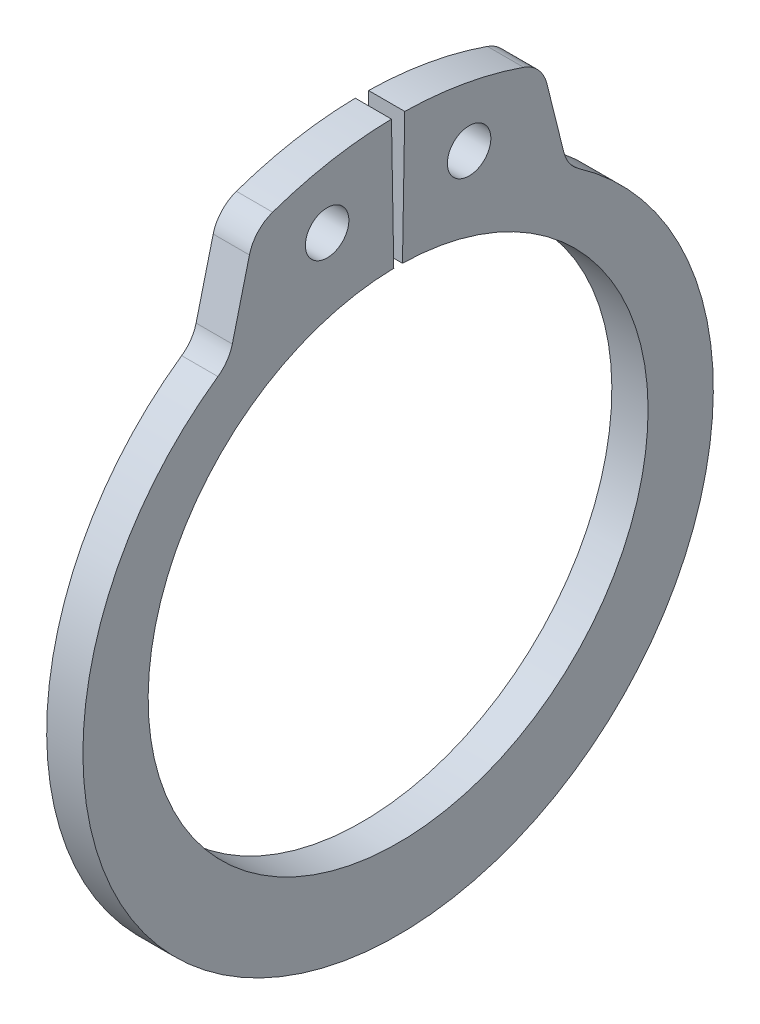
ISO-10303-21;
HEADER;
FILE_DESCRIPTION(('STEP AP214'),'2;1');
FILE_NAME('part.step','',(''),(''),'','','');
FILE_SCHEMA(('AUTOMOTIVE_DESIGN { 1 0 10303 214 1 1 1 1 }'));
ENDSEC;
DATA;
#1=APPLICATION_CONTEXT('core data for automotive mechanical design processes');
#2=APPLICATION_PROTOCOL_DEFINITION('international standard','automotive_design',2000,#1);
#3=PRODUCT_CONTEXT('',#1,'mechanical');
#4=PRODUCT('Part','Part','',(#3));
#5=PRODUCT_RELATED_PRODUCT_CATEGORY('part','',(#4));
#6=PRODUCT_DEFINITION_FORMATION('','',#4);
#7=PRODUCT_DEFINITION_CONTEXT('part definition',#1,'design');
#8=PRODUCT_DEFINITION('design','',#6,#7);
#9=PRODUCT_DEFINITION_SHAPE('','',#8);
#10=(LENGTH_UNIT() NAMED_UNIT(*) SI_UNIT(.MILLI.,.METRE.));
#11=(NAMED_UNIT(*) PLANE_ANGLE_UNIT() SI_UNIT($,.RADIAN.));
#12=(NAMED_UNIT(*) SI_UNIT($,.STERADIAN.) SOLID_ANGLE_UNIT());
#13=UNCERTAINTY_MEASURE_WITH_UNIT(LENGTH_MEASURE(1.E-05),#10,'distance_accuracy_value','');
#14=(GEOMETRIC_REPRESENTATION_CONTEXT(3) GLOBAL_UNCERTAINTY_ASSIGNED_CONTEXT((#13)) GLOBAL_UNIT_ASSIGNED_CONTEXT((#10,
#11,#12)) REPRESENTATION_CONTEXT('',''));
#15=CARTESIAN_POINT('',(0.,0.,0.));
#16=DIRECTION('',(0.,0.,1.));
#17=DIRECTION('',(1.,0.,0.));
#18=AXIS2_PLACEMENT_3D('',#15,#16,#17);
#19=CARTESIAN_POINT('',(-0.5,0.,0.));
#20=DIRECTION('',(1.,0.,0.));
#21=DIRECTION('',(0.,0.,-1.));
#22=AXIS2_PLACEMENT_3D('',#19,#20,#21);
#23=PLANE('',#22);
#24=CARTESIAN_POINT('',(-0.5,8.66711980549086,-1.9596288316201));
#25=DIRECTION('',(-1.,0.,0.));
#26=DIRECTION('',(0.,0.,1.));
#27=AXIS2_PLACEMENT_3D('',#24,#25,#26);
#28=CIRCLE('',#27,0.6);
#29=CARTESIAN_POINT('',(-0.5,8.66711980549086,-1.3596288316201));
#30=VERTEX_POINT('',#29);
#31=EDGE_CURVE('E147',#30,#30,#28,.F.);
#32=ORIENTED_EDGE('',*,*,#31,.T.);
#33=EDGE_LOOP('',(#32));
#34=FACE_BOUND('',#33,.T.);
#35=CARTESIAN_POINT('',(-0.5,8.96816184312502,3.13401869099666));
#36=DIRECTION('',(-1.,0.,0.));
#37=DIRECTION('',(0.,0.,1.));
#38=AXIS2_PLACEMENT_3D('',#35,#36,#37);
#39=CIRCLE('',#38,1.);
#40=CARTESIAN_POINT('',(-0.5,9.91217887924345,3.46391539531209));
#41=VERTEX_POINT('',#40);
#42=CARTESIAN_POINT('',(-0.5,9.21008373872469,4.10431441727265));
#43=VERTEX_POINT('',#42);
#44=EDGE_CURVE('E130',#41,#43,#39,.F.);
#45=ORIENTED_EDGE('',*,*,#44,.F.);
#46=CARTESIAN_POINT('',(-0.5,0.,0.));
#47=DIRECTION('',(-1.,0.,0.));
#48=DIRECTION('',(0.,0.,1.));
#49=AXIS2_PLACEMENT_3D('',#46,#47,#48);
#50=CIRCLE('',#49,10.5);
#51=CARTESIAN_POINT('',(-0.5,10.4984007991421,0.183250267591477));
#52=VERTEX_POINT('',#51);
#53=EDGE_CURVE('E123',#52,#41,#50,.F.);
#54=ORIENTED_EDGE('',*,*,#53,.F.);
#55=DIRECTION('',(0.,-0.999847695156391,-0.0174524064372835));
#56=VECTOR('',#55,1.);
#57=CARTESIAN_POINT('',(-0.5,6.8989490965791,0.120421604417256));
#58=LINE('',#57,#56);
#59=CARTESIAN_POINT('',(-0.5,6.8989490965791,0.120421604417256));
#60=VERTEX_POINT('',#59);
#61=EDGE_CURVE('E127',#52,#60,#58,.T.);
#62=ORIENTED_EDGE('',*,*,#61,.T.);
#63=CARTESIAN_POINT('',(-0.5,0.,0.));
#64=DIRECTION('',(-1.,0.,0.));
#65=DIRECTION('',(0.,0.,1.));
#66=AXIS2_PLACEMENT_3D('',#63,#64,#65);
#67=CIRCLE('',#66,6.9);
#68=CARTESIAN_POINT('',(-0.5,6.8989490965791,-0.120421604417256));
#69=VERTEX_POINT('',#68);
#70=EDGE_CURVE('E204',#60,#69,#67,.F.);
#71=ORIENTED_EDGE('',*,*,#70,.T.);
#72=DIRECTION('',(0.,0.999847695156391,-0.0174524064372841));
#73=VECTOR('',#72,1.);
#74=CARTESIAN_POINT('',(-0.5,10.4984007991421,-0.183250267591479));
#75=LINE('',#74,#73);
#76=CARTESIAN_POINT('',(-0.5,10.4984007991421,-0.183250267591479));
#77=VERTEX_POINT('',#76);
#78=EDGE_CURVE('E157',#69,#77,#75,.T.);
#79=ORIENTED_EDGE('',*,*,#78,.T.);
#80=CARTESIAN_POINT('',(-0.5,0.,0.));
#81=DIRECTION('',(-1.,0.,0.));
#82=DIRECTION('',(0.,0.,1.));
#83=AXIS2_PLACEMENT_3D('',#80,#81,#82);
#84=CIRCLE('',#83,10.5);
#85=CARTESIAN_POINT('',(-0.5,9.91217887924345,-3.46391539531209));
#86=VERTEX_POINT('',#85);
#87=EDGE_CURVE('E207',#86,#77,#84,.F.);
#88=ORIENTED_EDGE('',*,*,#87,.F.);
#89=CARTESIAN_POINT('',(-0.5,8.96816184312502,-3.13401869099665));
#90=DIRECTION('',(-1.,0.,0.));
#91=DIRECTION('',(0.,0.,1.));
#92=AXIS2_PLACEMENT_3D('',#89,#90,#91);
#93=CIRCLE('',#92,1.);
#94=CARTESIAN_POINT('',(-0.5,9.21008373872469,-4.10431441727265));
#95=VERTEX_POINT('',#94);
#96=EDGE_CURVE('E211',#95,#86,#93,.F.);
#97=ORIENTED_EDGE('',*,*,#96,.F.);
#98=DIRECTION('',(0.,-0.970295726275997,-0.241921895599666));
#99=VECTOR('',#98,1.);
#100=CARTESIAN_POINT('',(-0.5,9.71734472745919,-3.97784004803122));
#101=LINE('',#100,#99);
#102=CARTESIAN_POINT('',(-0.5,7.31761530924591,-4.57615979123836));
#103=VERTEX_POINT('',#102);
#104=EDGE_CURVE('E163',#95,#103,#101,.T.);
#105=ORIENTED_EDGE('',*,*,#104,.T.);
#106=CARTESIAN_POINT('',(-0.5,7.55953720484558,-5.54645551751436));
#107=DIRECTION('',(-1.,0.,0.));
#108=DIRECTION('',(0.,0.,1.));
#109=AXIS2_PLACEMENT_3D('',#106,#107,#108);
#110=CIRCLE('',#109,1.);
#111=CARTESIAN_POINT('',(-0.5,6.73911195964233,-4.97470170945253));
#112=VERTEX_POINT('',#111);
#113=EDGE_CURVE('E214',#103,#112,#110,.F.);
#114=ORIENTED_EDGE('',*,*,#113,.T.);
#115=CARTESIAN_POINT('',(-0.5,-0.399224177769538,0.));
#116=DIRECTION('',(-1.,0.,0.));
#117=DIRECTION('',(0.,0.,1.));
#118=AXIS2_PLACEMENT_3D('',#115,#116,#117);
#119=CIRCLE('',#118,8.70077582223046);
#120=CARTESIAN_POINT('',(-0.5,6.73911195964233,4.97470170945253));
#121=VERTEX_POINT('',#120);
#122=EDGE_CURVE('E218',#121,#112,#119,.F.);
#123=ORIENTED_EDGE('',*,*,#122,.F.);
#124=CARTESIAN_POINT('',(-0.5,7.55953720484558,5.54645551751436));
#125=DIRECTION('',(-1.,0.,0.));
#126=DIRECTION('',(0.,0.,1.));
#127=AXIS2_PLACEMENT_3D('',#124,#125,#126);
#128=CIRCLE('',#127,1.);
#129=CARTESIAN_POINT('',(-0.5,7.31761530924591,4.57615979123836));
#130=VERTEX_POINT('',#129);
#131=EDGE_CURVE('E170',#121,#130,#128,.F.);
#132=ORIENTED_EDGE('',*,*,#131,.T.);
#133=DIRECTION('',(0.,0.970295726275997,-0.241921895599665));
#134=VECTOR('',#133,1.);
#135=CARTESIAN_POINT('',(-0.5,9.71734472745919,3.97784004803122));
#136=LINE('',#135,#134);
#137=EDGE_CURVE('E169',#130,#43,#136,.T.);
#138=ORIENTED_EDGE('',*,*,#137,.T.);
#139=EDGE_LOOP('',(#45,#54,#62,#71,#79,#88,#97,#105,#114,#123,#132,#138));
#140=FACE_BOUND('',#139,.T.);
#141=CARTESIAN_POINT('',(-0.5,8.66711980549086,1.9596288316201));
#142=DIRECTION('',(-1.,0.,0.));
#143=DIRECTION('',(0.,0.,1.));
#144=AXIS2_PLACEMENT_3D('',#141,#142,#143);
#145=CIRCLE('',#144,0.6);
#146=CARTESIAN_POINT('',(-0.5,8.66711980549086,2.5596288316201));
#147=VERTEX_POINT('',#146);
#148=EDGE_CURVE('E20',#147,#147,#145,.F.);
#149=ORIENTED_EDGE('',*,*,#148,.T.);
#150=EDGE_LOOP('',(#149));
#151=FACE_BOUND('',#150,.T.);
#152=ADVANCED_FACE('F17',(#34,#140,#151),#23,.F.);
#153=CARTESIAN_POINT('',(0.5,8.66711980549086,1.9596288316201));
#154=DIRECTION('',(-1.,0.,0.));
#155=DIRECTION('',(0.,0.,1.));
#156=AXIS2_PLACEMENT_3D('',#153,#154,#155);
#157=CYLINDRICAL_SURFACE('',#156,0.6);
#158=CARTESIAN_POINT('',(0.5,8.66711980549086,1.9596288316201));
#159=DIRECTION('',(-1.,0.,0.));
#160=DIRECTION('',(0.,0.,1.));
#161=AXIS2_PLACEMENT_3D('',#158,#159,#160);
#162=CIRCLE('',#161,0.6);
#163=CARTESIAN_POINT('',(0.5,8.66711980549086,2.5596288316201));
#164=VERTEX_POINT('',#163);
#165=EDGE_CURVE('E152',#164,#164,#162,.T.);
#166=ORIENTED_EDGE('',*,*,#165,.F.);
#167=EDGE_LOOP('',(#166));
#168=FACE_BOUND('',#167,.T.);
#169=ORIENTED_EDGE('',*,*,#148,.F.);
#170=EDGE_LOOP('',(#169));
#171=FACE_BOUND('',#170,.T.);
#172=ADVANCED_FACE('F319',(#168,#171),#157,.F.);
#173=CARTESIAN_POINT('',(0.5,0.,0.));
#174=DIRECTION('',(-1.,0.,0.));
#175=DIRECTION('',(0.,0.,1.));
#176=AXIS2_PLACEMENT_3D('',#173,#174,#175);
#177=CYLINDRICAL_SURFACE('',#176,10.5);
#178=CARTESIAN_POINT('',(0.5,0.,0.));
#179=DIRECTION('',(-1.,0.,0.));
#180=DIRECTION('',(0.,0.,1.));
#181=AXIS2_PLACEMENT_3D('',#178,#179,#180);
#182=CIRCLE('',#181,10.5);
#183=CARTESIAN_POINT('',(0.5,10.4984007991421,0.183250267591477));
#184=VERTEX_POINT('',#183);
#185=CARTESIAN_POINT('',(0.5,9.91217887924345,3.46391539531209));
#186=VERTEX_POINT('',#185);
#187=EDGE_CURVE('E139',#184,#186,#182,.F.);
#188=ORIENTED_EDGE('',*,*,#187,.F.);
#189=DIRECTION('',(1.,0.,0.));
#190=VECTOR('',#189,1.);
#191=CARTESIAN_POINT('',(0.5,10.4984007991421,0.183250267591477));
#192=LINE('',#191,#190);
#193=EDGE_CURVE('E136',#184,#52,#192,.F.);
#194=ORIENTED_EDGE('',*,*,#193,.T.);
#195=ORIENTED_EDGE('',*,*,#53,.T.);
#196=DIRECTION('',(-1.,0.,0.));
#197=VECTOR('',#196,1.);
#198=CARTESIAN_POINT('',(0.5,9.91217887924345,3.46391539531209));
#199=LINE('',#198,#197);
#200=EDGE_CURVE('E134',#186,#41,#199,.T.);
#201=ORIENTED_EDGE('',*,*,#200,.F.);
#202=EDGE_LOOP('',(#188,#194,#195,#201));
#203=FACE_BOUND('',#202,.T.);
#204=ADVANCED_FACE('F137',(#203),#177,.T.);
#205=CARTESIAN_POINT('',(0.5,8.96816184312502,3.13401869099666));
#206=DIRECTION('',(-1.,0.,0.));
#207=DIRECTION('',(0.,0.,1.));
#208=AXIS2_PLACEMENT_3D('',#205,#206,#207);
#209=CYLINDRICAL_SURFACE('',#208,1.);
#210=ORIENTED_EDGE('',*,*,#44,.T.);
#211=DIRECTION('',(1.,0.,0.));
#212=VECTOR('',#211,1.);
#213=CARTESIAN_POINT('',(0.5,9.21008373872469,4.10431441727265));
#214=LINE('',#213,#212);
#215=CARTESIAN_POINT('',(0.5,9.21008373872469,4.10431441727265));
#216=VERTEX_POINT('',#215);
#217=EDGE_CURVE('E171',#43,#216,#214,.T.);
#218=ORIENTED_EDGE('',*,*,#217,.T.);
#219=CARTESIAN_POINT('',(0.5,8.96816184312502,3.13401869099666));
#220=DIRECTION('',(-1.,0.,0.));
#221=DIRECTION('',(0.,0.,1.));
#222=AXIS2_PLACEMENT_3D('',#219,#220,#221);
#223=CIRCLE('',#222,1.);
#224=EDGE_CURVE('E196',#186,#216,#223,.F.);
#225=ORIENTED_EDGE('',*,*,#224,.F.);
#226=ORIENTED_EDGE('',*,*,#200,.T.);
#227=EDGE_LOOP('',(#210,#218,#225,#226));
#228=FACE_BOUND('',#227,.T.);
#229=ADVANCED_FACE('F227',(#228),#209,.T.);
#230=CARTESIAN_POINT('',(0.5,9.71734472745919,3.97784004803122));
#231=DIRECTION('',(0.,-0.241921895599665,-0.970295726275997));
#232=DIRECTION('',(0.,0.970295726275997,-0.241921895599665));
#233=AXIS2_PLACEMENT_3D('',#230,#231,#232);
#234=PLANE('',#233);
#235=DIRECTION('',(-1.,0.,0.));
#236=VECTOR('',#235,1.);
#237=CARTESIAN_POINT('',(0.5,7.31761530924591,4.57615979123836));
#238=LINE('',#237,#236);
#239=CARTESIAN_POINT('',(0.5,7.31761530924591,4.57615979123836));
#240=VERTEX_POINT('',#239);
#241=EDGE_CURVE('E224',#130,#240,#238,.F.);
#242=ORIENTED_EDGE('',*,*,#241,.T.);
#243=DIRECTION('',(0.,-0.970295726275997,0.241921895599665));
#244=VECTOR('',#243,1.);
#245=CARTESIAN_POINT('',(0.5,9.21008373872469,4.10431441727265));
#246=LINE('',#245,#244);
#247=EDGE_CURVE('E195',#216,#240,#246,.T.);
#248=ORIENTED_EDGE('',*,*,#247,.F.);
#249=ORIENTED_EDGE('',*,*,#217,.F.);
#250=ORIENTED_EDGE('',*,*,#137,.F.);
#251=EDGE_LOOP('',(#242,#248,#249,#250));
#252=FACE_BOUND('',#251,.T.);
#253=ADVANCED_FACE('F265',(#252),#234,.F.);
#254=CARTESIAN_POINT('',(0.5,7.55953720484558,5.54645551751436));
#255=DIRECTION('',(-1.,0.,0.));
#256=DIRECTION('',(0.,0.,1.));
#257=AXIS2_PLACEMENT_3D('',#254,#255,#256);
#258=CYLINDRICAL_SURFACE('',#257,1.);
#259=ORIENTED_EDGE('',*,*,#241,.F.);
#260=ORIENTED_EDGE('',*,*,#131,.F.);
#261=DIRECTION('',(-1.,0.,0.));
#262=VECTOR('',#261,1.);
#263=CARTESIAN_POINT('',(0.5,6.73911195964233,4.97470170945253));
#264=LINE('',#263,#262);
#265=CARTESIAN_POINT('',(0.5,6.73911195964233,4.97470170945253));
#266=VERTEX_POINT('',#265);
#267=EDGE_CURVE('E222',#266,#121,#264,.T.);
#268=ORIENTED_EDGE('',*,*,#267,.F.);
#269=CARTESIAN_POINT('',(0.5,7.55953720484558,5.54645551751436));
#270=DIRECTION('',(-1.,0.,0.));
#271=DIRECTION('',(0.,0.,1.));
#272=AXIS2_PLACEMENT_3D('',#269,#270,#271);
#273=CIRCLE('',#272,1.);
#274=EDGE_CURVE('E192',#240,#266,#273,.T.);
#275=ORIENTED_EDGE('',*,*,#274,.F.);
#276=EDGE_LOOP('',(#259,#260,#268,#275));
#277=FACE_BOUND('',#276,.T.);
#278=ADVANCED_FACE('F268',(#277),#258,.F.);
#279=CARTESIAN_POINT('',(0.5,-0.399224177769538,0.));
#280=DIRECTION('',(-1.,0.,0.));
#281=DIRECTION('',(0.,0.,1.));
#282=AXIS2_PLACEMENT_3D('',#279,#280,#281);
#283=CYLINDRICAL_SURFACE('',#282,8.70077582223046);
#284=ORIENTED_EDGE('',*,*,#122,.T.);
#285=DIRECTION('',(-1.,0.,0.));
#286=VECTOR('',#285,1.);
#287=CARTESIAN_POINT('',(0.5,6.73911195964233,-4.97470170945253));
#288=LINE('',#287,#286);
#289=CARTESIAN_POINT('',(0.5,6.73911195964233,-4.97470170945253));
#290=VERTEX_POINT('',#289);
#291=EDGE_CURVE('E217',#112,#290,#288,.F.);
#292=ORIENTED_EDGE('',*,*,#291,.T.);
#293=CARTESIAN_POINT('',(0.5,-0.399224177769538,0.));
#294=DIRECTION('',(-1.,0.,0.));
#295=DIRECTION('',(0.,0.,1.));
#296=AXIS2_PLACEMENT_3D('',#293,#294,#295);
#297=CIRCLE('',#296,8.70077582223046);
#298=EDGE_CURVE('E189',#266,#290,#297,.F.);
#299=ORIENTED_EDGE('',*,*,#298,.F.);
#300=ORIENTED_EDGE('',*,*,#267,.T.);
#301=EDGE_LOOP('',(#284,#292,#299,#300));
#302=FACE_BOUND('',#301,.T.);
#303=ADVANCED_FACE('F273',(#302),#283,.T.);
#304=CARTESIAN_POINT('',(0.5,7.55953720484558,-5.54645551751436));
#305=DIRECTION('',(-1.,0.,0.));
#306=DIRECTION('',(0.,0.,1.));
#307=AXIS2_PLACEMENT_3D('',#304,#305,#306);
#308=CYLINDRICAL_SURFACE('',#307,1.);
#309=ORIENTED_EDGE('',*,*,#291,.F.);
#310=ORIENTED_EDGE('',*,*,#113,.F.);
#311=DIRECTION('',(1.,0.,0.));
#312=VECTOR('',#311,1.);
#313=CARTESIAN_POINT('',(0.5,7.31761530924591,-4.57615979123836));
#314=LINE('',#313,#312);
#315=CARTESIAN_POINT('',(0.5,7.31761530924591,-4.57615979123836));
#316=VERTEX_POINT('',#315);
#317=EDGE_CURVE('E168',#103,#316,#314,.T.);
#318=ORIENTED_EDGE('',*,*,#317,.T.);
#319=CARTESIAN_POINT('',(0.5,7.55953720484558,-5.54645551751436));
#320=DIRECTION('',(-1.,0.,0.));
#321=DIRECTION('',(0.,0.,1.));
#322=AXIS2_PLACEMENT_3D('',#319,#320,#321);
#323=CIRCLE('',#322,1.);
#324=EDGE_CURVE('E185',#290,#316,#323,.T.);
#325=ORIENTED_EDGE('',*,*,#324,.F.);
#326=EDGE_LOOP('',(#309,#310,#318,#325));
#327=FACE_BOUND('',#326,.T.);
#328=ADVANCED_FACE('F275',(#327),#308,.F.);
#329=CARTESIAN_POINT('',(0.5,9.71734472745919,-3.97784004803122));
#330=DIRECTION('',(0.,-0.241921895599666,0.970295726275997));
#331=DIRECTION('',(0.,-0.970295726275997,-0.241921895599666));
#332=AXIS2_PLACEMENT_3D('',#329,#330,#331);
#333=PLANE('',#332);
#334=DIRECTION('',(-1.,0.,0.));
#335=VECTOR('',#334,1.);
#336=CARTESIAN_POINT('',(0.5,9.21008373872469,-4.10431441727265));
#337=LINE('',#336,#335);
#338=CARTESIAN_POINT('',(0.5,9.21008373872469,-4.10431441727265));
#339=VERTEX_POINT('',#338);
#340=EDGE_CURVE('E167',#339,#95,#337,.T.);
#341=ORIENTED_EDGE('',*,*,#340,.F.);
#342=DIRECTION('',(0.,0.970295726275997,0.241921895599666));
#343=VECTOR('',#342,1.);
#344=CARTESIAN_POINT('',(0.5,7.31761530924591,-4.57615979123836));
#345=LINE('',#344,#343);
#346=EDGE_CURVE('E184',#316,#339,#345,.T.);
#347=ORIENTED_EDGE('',*,*,#346,.F.);
#348=ORIENTED_EDGE('',*,*,#317,.F.);
#349=ORIENTED_EDGE('',*,*,#104,.F.);
#350=EDGE_LOOP('',(#341,#347,#348,#349));
#351=FACE_BOUND('',#350,.T.);
#352=ADVANCED_FACE('F279',(#351),#333,.F.);
#353=CARTESIAN_POINT('',(0.5,8.96816184312502,-3.13401869099665));
#354=DIRECTION('',(-1.,0.,0.));
#355=DIRECTION('',(0.,0.,1.));
#356=AXIS2_PLACEMENT_3D('',#353,#354,#355);
#357=CYLINDRICAL_SURFACE('',#356,1.);
#358=ORIENTED_EDGE('',*,*,#96,.T.);
#359=DIRECTION('',(-1.,0.,0.));
#360=VECTOR('',#359,1.);
#361=CARTESIAN_POINT('',(0.5,9.91217887924345,-3.46391539531209));
#362=LINE('',#361,#360);
#363=CARTESIAN_POINT('',(0.5,9.91217887924345,-3.46391539531209));
#364=VERTEX_POINT('',#363);
#365=EDGE_CURVE('E210',#364,#86,#362,.T.);
#366=ORIENTED_EDGE('',*,*,#365,.F.);
#367=CARTESIAN_POINT('',(0.5,8.96816184312502,-3.13401869099665));
#368=DIRECTION('',(-1.,0.,0.));
#369=DIRECTION('',(0.,0.,1.));
#370=AXIS2_PLACEMENT_3D('',#367,#368,#369);
#371=CIRCLE('',#370,1.);
#372=EDGE_CURVE('E180',#339,#364,#371,.F.);
#373=ORIENTED_EDGE('',*,*,#372,.F.);
#374=ORIENTED_EDGE('',*,*,#340,.T.);
#375=EDGE_LOOP('',(#358,#366,#373,#374));
#376=FACE_BOUND('',#375,.T.);
#377=ADVANCED_FACE('F283',(#376),#357,.T.);
#378=CARTESIAN_POINT('',(0.5,0.,0.));
#379=DIRECTION('',(-1.,0.,0.));
#380=DIRECTION('',(0.,0.,1.));
#381=AXIS2_PLACEMENT_3D('',#378,#379,#380);
#382=CYLINDRICAL_SURFACE('',#381,10.5);
#383=ORIENTED_EDGE('',*,*,#87,.T.);
#384=DIRECTION('',(1.,0.,0.));
#385=VECTOR('',#384,1.);
#386=CARTESIAN_POINT('',(0.5,10.4984007991421,-0.183250267591479));
#387=LINE('',#386,#385);
#388=CARTESIAN_POINT('',(0.5,10.4984007991421,-0.183250267591479));
#389=VERTEX_POINT('',#388);
#390=EDGE_CURVE('E162',#77,#389,#387,.T.);
#391=ORIENTED_EDGE('',*,*,#390,.T.);
#392=CARTESIAN_POINT('',(0.5,0.,0.));
#393=DIRECTION('',(-1.,0.,0.));
#394=DIRECTION('',(0.,0.,1.));
#395=AXIS2_PLACEMENT_3D('',#392,#393,#394);
#396=CIRCLE('',#395,10.5);
#397=EDGE_CURVE('E176',#364,#389,#396,.F.);
#398=ORIENTED_EDGE('',*,*,#397,.F.);
#399=ORIENTED_EDGE('',*,*,#365,.T.);
#400=EDGE_LOOP('',(#383,#391,#398,#399));
#401=FACE_BOUND('',#400,.T.);
#402=ADVANCED_FACE('F287',(#401),#382,.T.);
#403=CARTESIAN_POINT('',(0.5,10.4984007991421,-0.183250267591479));
#404=DIRECTION('',(0.,-0.0174524064372841,-0.999847695156391));
#405=DIRECTION('',(0.,0.999847695156391,-0.0174524064372841));
#406=AXIS2_PLACEMENT_3D('',#403,#404,#405);
#407=PLANE('',#406);
#408=DIRECTION('',(-1.,0.,0.));
#409=VECTOR('',#408,1.);
#410=CARTESIAN_POINT('',(0.5,6.8989490965791,-0.120421604417256));
#411=LINE('',#410,#409);
#412=CARTESIAN_POINT('',(0.5,6.8989490965791,-0.120421604417256));
#413=VERTEX_POINT('',#412);
#414=EDGE_CURVE('E161',#69,#413,#411,.F.);
#415=ORIENTED_EDGE('',*,*,#414,.T.);
#416=DIRECTION('',(0.,-0.999847695156391,0.017452406437284));
#417=VECTOR('',#416,1.);
#418=CARTESIAN_POINT('',(0.5,10.4984007991421,-0.183250267591479));
#419=LINE('',#418,#417);
#420=EDGE_CURVE('E175',#389,#413,#419,.T.);
#421=ORIENTED_EDGE('',*,*,#420,.F.);
#422=ORIENTED_EDGE('',*,*,#390,.F.);
#423=ORIENTED_EDGE('',*,*,#78,.F.);
#424=EDGE_LOOP('',(#415,#421,#422,#423));
#425=FACE_BOUND('',#424,.T.);
#426=ADVANCED_FACE('F292',(#425),#407,.F.);
#427=CARTESIAN_POINT('',(0.5,0.,0.));
#428=DIRECTION('',(-1.,0.,0.));
#429=DIRECTION('',(0.,0.,1.));
#430=AXIS2_PLACEMENT_3D('',#427,#428,#429);
#431=CYLINDRICAL_SURFACE('',#430,6.9);
#432=DIRECTION('',(1.,0.,0.));
#433=VECTOR('',#432,1.);
#434=CARTESIAN_POINT('',(0.5,6.8989490965791,0.120421604417256));
#435=LINE('',#434,#433);
#436=CARTESIAN_POINT('',(0.5,6.8989490965791,0.120421604417256));
#437=VERTEX_POINT('',#436);
#438=EDGE_CURVE('E143',#60,#437,#435,.T.);
#439=ORIENTED_EDGE('',*,*,#438,.T.);
#440=CARTESIAN_POINT('',(0.5,0.,0.));
#441=DIRECTION('',(-1.,0.,0.));
#442=DIRECTION('',(0.,0.,1.));
#443=AXIS2_PLACEMENT_3D('',#440,#441,#442);
#444=CIRCLE('',#443,6.9);
#445=EDGE_CURVE('E40',#413,#437,#444,.T.);
#446=ORIENTED_EDGE('',*,*,#445,.F.);
#447=ORIENTED_EDGE('',*,*,#414,.F.);
#448=ORIENTED_EDGE('',*,*,#70,.F.);
#449=EDGE_LOOP('',(#439,#446,#447,#448));
#450=FACE_BOUND('',#449,.T.);
#451=ADVANCED_FACE('F295',(#450),#431,.F.);
#452=CARTESIAN_POINT('',(0.5,6.8989490965791,0.120421604417256));
#453=DIRECTION('',(0.,-0.0174524064372835,0.999847695156391));
#454=DIRECTION('',(0.,-0.999847695156391,-0.0174524064372835));
#455=AXIS2_PLACEMENT_3D('',#452,#453,#454);
#456=PLANE('',#455);
#457=ORIENTED_EDGE('',*,*,#193,.F.);
#458=DIRECTION('',(0.,0.999847695156391,0.0174524064372835));
#459=VECTOR('',#458,1.);
#460=CARTESIAN_POINT('',(0.5,6.8989490965791,0.120421604417256));
#461=LINE('',#460,#459);
#462=EDGE_CURVE('E27',#437,#184,#461,.T.);
#463=ORIENTED_EDGE('',*,*,#462,.F.);
#464=ORIENTED_EDGE('',*,*,#438,.F.);
#465=ORIENTED_EDGE('',*,*,#61,.F.);
#466=EDGE_LOOP('',(#457,#463,#464,#465));
#467=FACE_BOUND('',#466,.T.);
#468=ADVANCED_FACE('F145',(#467),#456,.F.);
#469=CARTESIAN_POINT('',(0.5,8.66711980549086,-1.9596288316201));
#470=DIRECTION('',(-1.,0.,0.));
#471=DIRECTION('',(0.,0.,1.));
#472=AXIS2_PLACEMENT_3D('',#469,#470,#471);
#473=CYLINDRICAL_SURFACE('',#472,0.6);
#474=CARTESIAN_POINT('',(0.5,8.66711980549086,-1.9596288316201));
#475=DIRECTION('',(-1.,0.,0.));
#476=DIRECTION('',(0.,0.,1.));
#477=AXIS2_PLACEMENT_3D('',#474,#475,#476);
#478=CIRCLE('',#477,0.6);
#479=CARTESIAN_POINT('',(0.5,8.66711980549086,-1.3596288316201));
#480=VERTEX_POINT('',#479);
#481=EDGE_CURVE('E11',#480,#480,#478,.T.);
#482=ORIENTED_EDGE('',*,*,#481,.F.);
#483=EDGE_LOOP('',(#482));
#484=FACE_BOUND('',#483,.T.);
#485=ORIENTED_EDGE('',*,*,#31,.F.);
#486=EDGE_LOOP('',(#485));
#487=FACE_BOUND('',#486,.T.);
#488=ADVANCED_FACE('F303',(#484,#487),#473,.F.);
#489=CARTESIAN_POINT('',(0.5,0.,0.));
#490=DIRECTION('',(1.,0.,0.));
#491=DIRECTION('',(0.,0.,-1.));
#492=AXIS2_PLACEMENT_3D('',#489,#490,#491);
#493=PLANE('',#492);
#494=ORIENTED_EDGE('',*,*,#481,.T.);
#495=EDGE_LOOP('',(#494));
#496=FACE_BOUND('',#495,.T.);
#497=ORIENTED_EDGE('',*,*,#445,.T.);
#498=ORIENTED_EDGE('',*,*,#462,.T.);
#499=ORIENTED_EDGE('',*,*,#187,.T.);
#500=ORIENTED_EDGE('',*,*,#224,.T.);
#501=ORIENTED_EDGE('',*,*,#247,.T.);
#502=ORIENTED_EDGE('',*,*,#274,.T.);
#503=ORIENTED_EDGE('',*,*,#298,.T.);
#504=ORIENTED_EDGE('',*,*,#324,.T.);
#505=ORIENTED_EDGE('',*,*,#346,.T.);
#506=ORIENTED_EDGE('',*,*,#372,.T.);
#507=ORIENTED_EDGE('',*,*,#397,.T.);
#508=ORIENTED_EDGE('',*,*,#420,.T.);
#509=EDGE_LOOP('',(#497,#498,#499,#500,#501,#502,#503,#504,#505,#506,#507,#508));
#510=FACE_BOUND('',#509,.T.);
#511=ORIENTED_EDGE('',*,*,#165,.T.);
#512=EDGE_LOOP('',(#511));
#513=FACE_BOUND('',#512,.T.);
#514=ADVANCED_FACE('F231',(#496,#510,#513),#493,.T.);
#515=CLOSED_SHELL('',(#152,#172,#204,#229,#253,#278,#303,#328,#352,#377,#402,#426,#451,#468,
#488,#514));
#516=MANIFOLD_SOLID_BREP('B1',#515);
#517=ADVANCED_BREP_SHAPE_REPRESENTATION('',(#18,#516),#14);
#518=SHAPE_DEFINITION_REPRESENTATION(#9,#517);
ENDSEC;
END-ISO-10303-21;
